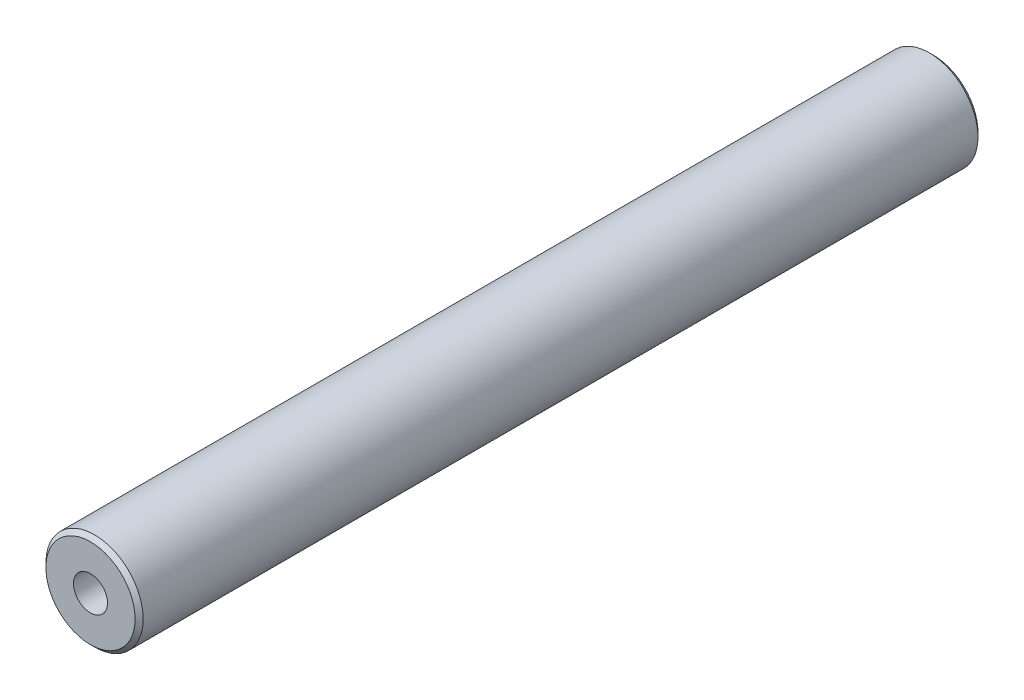
ISO-10303-21;
HEADER;
FILE_DESCRIPTION(('STEP AP214'),'2;1');
FILE_NAME('part.step','',(''),(''),'','','');
FILE_SCHEMA(('AUTOMOTIVE_DESIGN { 1 0 10303 214 1 1 1 1 }'));
ENDSEC;
DATA;
#1=APPLICATION_CONTEXT('core data for automotive mechanical design processes');
#2=APPLICATION_PROTOCOL_DEFINITION('international standard','automotive_design',2000,#1);
#3=PRODUCT_CONTEXT('',#1,'mechanical');
#4=PRODUCT('Part','Part','',(#3));
#5=PRODUCT_RELATED_PRODUCT_CATEGORY('part','',(#4));
#6=PRODUCT_DEFINITION_FORMATION('','',#4);
#7=PRODUCT_DEFINITION_CONTEXT('part definition',#1,'design');
#8=PRODUCT_DEFINITION('design','',#6,#7);
#9=PRODUCT_DEFINITION_SHAPE('','',#8);
#10=(LENGTH_UNIT() NAMED_UNIT(*) SI_UNIT(.MILLI.,.METRE.));
#11=(NAMED_UNIT(*) PLANE_ANGLE_UNIT() SI_UNIT($,.RADIAN.));
#12=(NAMED_UNIT(*) SI_UNIT($,.STERADIAN.) SOLID_ANGLE_UNIT());
#13=UNCERTAINTY_MEASURE_WITH_UNIT(LENGTH_MEASURE(1.E-05),#10,'distance_accuracy_value','');
#14=(GEOMETRIC_REPRESENTATION_CONTEXT(3) GLOBAL_UNCERTAINTY_ASSIGNED_CONTEXT((#13)) GLOBAL_UNIT_ASSIGNED_CONTEXT((#10,
#11,#12)) REPRESENTATION_CONTEXT('',''));
#15=CARTESIAN_POINT('',(0.,0.,0.));
#16=DIRECTION('',(0.,0.,1.));
#17=DIRECTION('',(1.,0.,0.));
#18=AXIS2_PLACEMENT_3D('',#15,#16,#17);
#19=CARTESIAN_POINT('',(0.,0.,104.));
#20=DIRECTION('',(0.,0.,-1.));
#21=DIRECTION('',(-1.,0.,0.));
#22=AXIS2_PLACEMENT_3D('',#19,#20,#21);
#23=CYLINDRICAL_SURFACE('',#22,6.);
#24=CARTESIAN_POINT('',(0.,0.,0.500000000000111));
#25=DIRECTION('',(0.,0.,1.));
#26=DIRECTION('',(1.,0.,0.));
#27=AXIS2_PLACEMENT_3D('',#24,#25,#26);
#28=CIRCLE('',#27,6.);
#29=CARTESIAN_POINT('',(6.,0.,0.500000000000111));
#30=VERTEX_POINT('',#29);
#31=EDGE_CURVE('E80',#30,#30,#28,.T.);
#32=ORIENTED_EDGE('',*,*,#31,.T.);
#33=EDGE_LOOP('',(#32));
#34=FACE_BOUND('',#33,.T.);
#35=CARTESIAN_POINT('',(0.,0.,103.5));
#36=DIRECTION('',(0.,0.,1.));
#37=DIRECTION('',(1.,0.,0.));
#38=AXIS2_PLACEMENT_3D('',#35,#36,#37);
#39=CIRCLE('',#38,6.);
#40=CARTESIAN_POINT('',(6.,0.,103.5));
#41=VERTEX_POINT('',#40);
#42=EDGE_CURVE('E77',#41,#41,#39,.F.);
#43=ORIENTED_EDGE('',*,*,#42,.T.);
#44=EDGE_LOOP('',(#43));
#45=FACE_BOUND('',#44,.T.);
#46=ADVANCED_FACE('F41',(#34,#45),#23,.T.);
#47=CARTESIAN_POINT('',(0.,0.,104.));
#48=DIRECTION('',(0.,0.,1.));
#49=DIRECTION('',(1.,0.,0.));
#50=AXIS2_PLACEMENT_3D('',#47,#48,#49);
#51=PLANE('',#50);
#52=CARTESIAN_POINT('',(0.,0.,104.));
#53=DIRECTION('',(0.,0.,1.));
#54=DIRECTION('',(1.,0.,0.));
#55=AXIS2_PLACEMENT_3D('',#52,#53,#54);
#56=CIRCLE('',#55,5.50000000000005);
#57=CARTESIAN_POINT('',(5.50000000000005,0.,104.));
#58=VERTEX_POINT('',#57);
#59=EDGE_CURVE('E11',#58,#58,#56,.T.);
#60=ORIENTED_EDGE('',*,*,#59,.T.);
#61=EDGE_LOOP('',(#60));
#62=FACE_BOUND('',#61,.T.);
#63=CARTESIAN_POINT('',(0.,0.,104.));
#64=DIRECTION('',(0.,0.,1.));
#65=DIRECTION('',(1.,0.,0.));
#66=AXIS2_PLACEMENT_3D('',#63,#64,#65);
#67=CIRCLE('',#66,2.1);
#68=CARTESIAN_POINT('',(2.1,0.,104.));
#69=VERTEX_POINT('',#68);
#70=EDGE_CURVE('E67',#69,#69,#67,.T.);
#71=ORIENTED_EDGE('',*,*,#70,.F.);
#72=EDGE_LOOP('',(#71));
#73=FACE_BOUND('',#72,.T.);
#74=ADVANCED_FACE('F95',(#62,#73),#51,.T.);
#75=CARTESIAN_POINT('',(0.,0.,0.));
#76=DIRECTION('',(0.,0.,1.));
#77=DIRECTION('',(1.,0.,0.));
#78=AXIS2_PLACEMENT_3D('',#75,#76,#77);
#79=PLANE('',#78);
#80=CARTESIAN_POINT('',(0.,0.,0.));
#81=DIRECTION('',(0.,0.,1.));
#82=DIRECTION('',(1.,0.,0.));
#83=AXIS2_PLACEMENT_3D('',#80,#81,#82);
#84=CIRCLE('',#83,5.49999999999989);
#85=CARTESIAN_POINT('',(5.49999999999989,0.,0.));
#86=VERTEX_POINT('',#85);
#87=EDGE_CURVE('E50',#86,#86,#84,.F.);
#88=ORIENTED_EDGE('',*,*,#87,.T.);
#89=EDGE_LOOP('',(#88));
#90=FACE_BOUND('',#89,.T.);
#91=CARTESIAN_POINT('',(0.,0.,0.));
#92=DIRECTION('',(0.,0.,-1.));
#93=DIRECTION('',(-1.,0.,0.));
#94=AXIS2_PLACEMENT_3D('',#91,#92,#93);
#95=CIRCLE('',#94,2.1);
#96=CARTESIAN_POINT('',(-2.1,0.,0.));
#97=VERTEX_POINT('',#96);
#98=EDGE_CURVE('E66',#97,#97,#95,.T.);
#99=ORIENTED_EDGE('',*,*,#98,.F.);
#100=EDGE_LOOP('',(#99));
#101=FACE_BOUND('',#100,.T.);
#102=ADVANCED_FACE('F85',(#90,#101),#79,.F.);
#103=CARTESIAN_POINT('',(0.,0.,20.));
#104=DIRECTION('',(0.,0.,-1.));
#105=DIRECTION('',(-1.,0.,0.));
#106=AXIS2_PLACEMENT_3D('',#103,#104,#105);
#107=CONICAL_SURFACE('',#106,2.1,1.02974425867665);
#108=CARTESIAN_POINT('',(0.,0.,21.2618072999579));
#109=VERTEX_POINT('',#108);
#110=VERTEX_LOOP('',#109);
#111=FACE_BOUND('',#110,.T.);
#112=CARTESIAN_POINT('',(0.,0.,20.));
#113=DIRECTION('',(0.,0.,-1.));
#114=DIRECTION('',(-1.,0.,0.));
#115=AXIS2_PLACEMENT_3D('',#112,#113,#114);
#116=CIRCLE('',#115,2.1);
#117=CARTESIAN_POINT('',(-2.1,0.,20.));
#118=VERTEX_POINT('',#117);
#119=EDGE_CURVE('E70',#118,#118,#116,.T.);
#120=ORIENTED_EDGE('',*,*,#119,.T.);
#121=EDGE_LOOP('',(#120));
#122=FACE_BOUND('',#121,.T.);
#123=ADVANCED_FACE('F115',(#111,#122),#107,.F.);
#124=CARTESIAN_POINT('',(0.,0.,0.));
#125=DIRECTION('',(0.,0.,-1.));
#126=DIRECTION('',(-1.,0.,0.));
#127=AXIS2_PLACEMENT_3D('',#124,#125,#126);
#128=CYLINDRICAL_SURFACE('',#127,2.1);
#129=ORIENTED_EDGE('',*,*,#119,.F.);
#130=EDGE_LOOP('',(#129));
#131=FACE_BOUND('',#130,.T.);
#132=ORIENTED_EDGE('',*,*,#98,.T.);
#133=EDGE_LOOP('',(#132));
#134=FACE_BOUND('',#133,.T.);
#135=ADVANCED_FACE('F60',(#131,#134),#128,.F.);
#136=CARTESIAN_POINT('',(0.,0.,84.));
#137=DIRECTION('',(0.,0.,1.));
#138=DIRECTION('',(1.,0.,0.));
#139=AXIS2_PLACEMENT_3D('',#136,#137,#138);
#140=CONICAL_SURFACE('',#139,2.1,1.02974425867666);
#141=CARTESIAN_POINT('',(0.,0.,82.7381927000421));
#142=VERTEX_POINT('',#141);
#143=VERTEX_LOOP('',#142);
#144=FACE_BOUND('',#143,.T.);
#145=CARTESIAN_POINT('',(0.,0.,84.));
#146=DIRECTION('',(0.,0.,1.));
#147=DIRECTION('',(1.,0.,0.));
#148=AXIS2_PLACEMENT_3D('',#145,#146,#147);
#149=CIRCLE('',#148,2.1);
#150=CARTESIAN_POINT('',(2.1,0.,84.));
#151=VERTEX_POINT('',#150);
#152=EDGE_CURVE('E64',#151,#151,#149,.T.);
#153=ORIENTED_EDGE('',*,*,#152,.T.);
#154=EDGE_LOOP('',(#153));
#155=FACE_BOUND('',#154,.T.);
#156=ADVANCED_FACE('F56',(#144,#155),#140,.F.);
#157=CARTESIAN_POINT('',(0.,0.,104.));
#158=DIRECTION('',(0.,0.,1.));
#159=DIRECTION('',(1.,0.,0.));
#160=AXIS2_PLACEMENT_3D('',#157,#158,#159);
#161=CYLINDRICAL_SURFACE('',#160,2.1);
#162=ORIENTED_EDGE('',*,*,#152,.F.);
#163=EDGE_LOOP('',(#162));
#164=FACE_BOUND('',#163,.T.);
#165=ORIENTED_EDGE('',*,*,#70,.T.);
#166=EDGE_LOOP('',(#165));
#167=FACE_BOUND('',#166,.T.);
#168=ADVANCED_FACE('F59',(#164,#167),#161,.F.);
#169=CARTESIAN_POINT('',(0.,0.,0.500000000000111));
#170=DIRECTION('',(0.,0.,1.));
#171=DIRECTION('',(1.,0.,0.));
#172=AXIS2_PLACEMENT_3D('',#169,#170,#171);
#173=CONICAL_SURFACE('',#172,6.,0.785398163397445);
#174=ORIENTED_EDGE('',*,*,#87,.F.);
#175=EDGE_LOOP('',(#174));
#176=FACE_BOUND('',#175,.T.);
#177=ORIENTED_EDGE('',*,*,#31,.F.);
#178=EDGE_LOOP('',(#177));
#179=FACE_BOUND('',#178,.T.);
#180=ADVANCED_FACE('F88',(#176,#179),#173,.T.);
#181=CARTESIAN_POINT('',(0.,0.,104.));
#182=DIRECTION('',(0.,0.,-1.));
#183=DIRECTION('',(-1.,0.,0.));
#184=AXIS2_PLACEMENT_3D('',#181,#182,#183);
#185=CONICAL_SURFACE('',#184,5.50000000000005,0.785398163397459);
#186=ORIENTED_EDGE('',*,*,#42,.F.);
#187=EDGE_LOOP('',(#186));
#188=FACE_BOUND('',#187,.T.);
#189=ORIENTED_EDGE('',*,*,#59,.F.);
#190=EDGE_LOOP('',(#189));
#191=FACE_BOUND('',#190,.T.);
#192=ADVANCED_FACE('F44',(#188,#191),#185,.T.);
#193=CLOSED_SHELL('',(#46,#74,#102,#123,#135,#156,#168,#180,#192));
#194=MANIFOLD_SOLID_BREP('B2',#193);
#195=ADVANCED_BREP_SHAPE_REPRESENTATION('',(#18,#194),#14);
#196=SHAPE_DEFINITION_REPRESENTATION(#9,#195);
ENDSEC;
END-ISO-10303-21;
